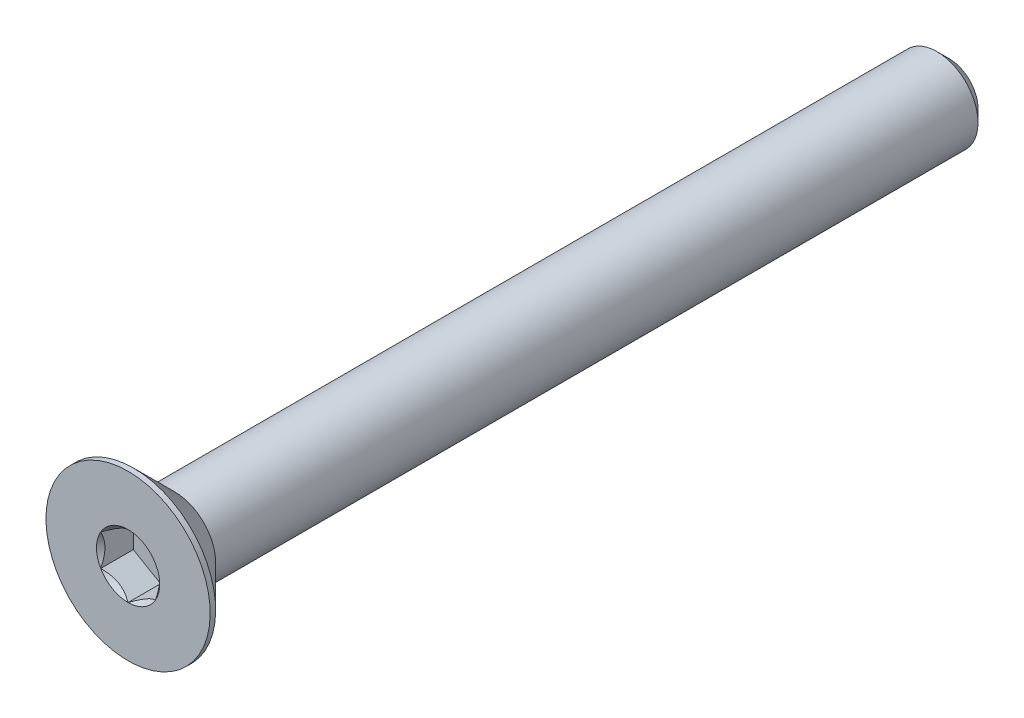
ISO-10303-21;
HEADER;
FILE_DESCRIPTION(('STEP AP214'),'2;1');
FILE_NAME('part.step','',(''),(''),'','','');
FILE_SCHEMA(('AUTOMOTIVE_DESIGN { 1 0 10303 214 1 1 1 1 }'));
ENDSEC;
DATA;
#1=APPLICATION_CONTEXT('core data for automotive mechanical design processes');
#2=APPLICATION_PROTOCOL_DEFINITION('international standard','automotive_design',2000,#1);
#3=PRODUCT_CONTEXT('',#1,'mechanical');
#4=PRODUCT('Part','Part','',(#3));
#5=PRODUCT_RELATED_PRODUCT_CATEGORY('part','',(#4));
#6=PRODUCT_DEFINITION_FORMATION('','',#4);
#7=PRODUCT_DEFINITION_CONTEXT('part definition',#1,'design');
#8=PRODUCT_DEFINITION('design','',#6,#7);
#9=PRODUCT_DEFINITION_SHAPE('','',#8);
#10=(LENGTH_UNIT() NAMED_UNIT(*) SI_UNIT(.MILLI.,.METRE.));
#11=(NAMED_UNIT(*) PLANE_ANGLE_UNIT() SI_UNIT($,.RADIAN.));
#12=(NAMED_UNIT(*) SI_UNIT($,.STERADIAN.) SOLID_ANGLE_UNIT());
#13=UNCERTAINTY_MEASURE_WITH_UNIT(LENGTH_MEASURE(1.E-05),#10,'distance_accuracy_value','');
#14=(GEOMETRIC_REPRESENTATION_CONTEXT(3) GLOBAL_UNCERTAINTY_ASSIGNED_CONTEXT((#13)) GLOBAL_UNIT_ASSIGNED_CONTEXT((#10,
#11,#12)) REPRESENTATION_CONTEXT('',''));
#15=CARTESIAN_POINT('',(0.,0.,0.));
#16=DIRECTION('',(0.,0.,1.));
#17=DIRECTION('',(1.,0.,0.));
#18=AXIS2_PLACEMENT_3D('',#15,#16,#17);
#19=CARTESIAN_POINT('',(0.,0.,-15.));
#20=DIRECTION('',(0.,0.,-1.));
#21=DIRECTION('',(0.,1.,0.));
#22=AXIS2_PLACEMENT_3D('',#19,#20,#21);
#23=CYLINDRICAL_SURFACE('',#22,1.5);
#24=CARTESIAN_POINT('',(0.,0.,13.3));
#25=DIRECTION('',(0.,0.,-1.));
#26=DIRECTION('',(0.,1.,0.));
#27=AXIS2_PLACEMENT_3D('',#24,#25,#26);
#28=CIRCLE('',#27,1.5);
#29=CARTESIAN_POINT('',(0.,1.5,13.3));
#30=VERTEX_POINT('',#29);
#31=EDGE_CURVE('E11',#30,#30,#28,.F.);
#32=ORIENTED_EDGE('',*,*,#31,.F.);
#33=EDGE_LOOP('',(#32));
#34=FACE_BOUND('',#33,.T.);
#35=CARTESIAN_POINT('',(0.,0.,-14.55));
#36=DIRECTION('',(0.,0.,-1.));
#37=DIRECTION('',(0.,1.,0.));
#38=AXIS2_PLACEMENT_3D('',#35,#36,#37);
#39=CIRCLE('',#38,1.5);
#40=CARTESIAN_POINT('',(0.,1.5,-14.55));
#41=VERTEX_POINT('',#40);
#42=EDGE_CURVE('E50',#41,#41,#39,.F.);
#43=ORIENTED_EDGE('',*,*,#42,.T.);
#44=EDGE_LOOP('',(#43));
#45=FACE_BOUND('',#44,.T.);
#46=ADVANCED_FACE('F41',(#34,#45),#23,.T.);
#47=CARTESIAN_POINT('',(0.,1.5,-15.));
#48=DIRECTION('',(0.,0.,-1.));
#49=DIRECTION('',(0.,1.,0.));
#50=AXIS2_PLACEMENT_3D('',#47,#48,#49);
#51=PLANE('',#50);
#52=CARTESIAN_POINT('',(0.,0.,-15.));
#53=DIRECTION('',(0.,0.,-1.));
#54=DIRECTION('',(0.,1.,0.));
#55=AXIS2_PLACEMENT_3D('',#52,#53,#54);
#56=CIRCLE('',#55,1.04999999999999);
#57=CARTESIAN_POINT('',(0.,1.05,-15.));
#58=VERTEX_POINT('',#57);
#59=EDGE_CURVE('E166',#58,#58,#56,.T.);
#60=ORIENTED_EDGE('',*,*,#59,.T.);
#61=EDGE_LOOP('',(#60));
#62=FACE_BOUND('',#61,.T.);
#63=ADVANCED_FACE('F177',(#62),#51,.T.);
#64=CARTESIAN_POINT('',(0.,0.,-15.));
#65=DIRECTION('',(0.,0.,1.));
#66=DIRECTION('',(0.,-1.,0.));
#67=AXIS2_PLACEMENT_3D('',#64,#65,#66);
#68=CONICAL_SURFACE('',#67,1.05,0.785398163397453);
#69=ORIENTED_EDGE('',*,*,#42,.F.);
#70=EDGE_LOOP('',(#69));
#71=FACE_BOUND('',#70,.T.);
#72=ORIENTED_EDGE('',*,*,#59,.F.);
#73=EDGE_LOOP('',(#72));
#74=FACE_BOUND('',#73,.T.);
#75=ADVANCED_FACE('F43',(#71,#74),#68,.T.);
#76=CARTESIAN_POINT('',(0.,0.,-15.));
#77=DIRECTION('',(0.,0.,-1.));
#78=DIRECTION('',(0.,1.,0.));
#79=AXIS2_PLACEMENT_3D('',#76,#77,#78);
#80=CYLINDRICAL_SURFACE('',#79,3.);
#81=CARTESIAN_POINT('',(0.,0.,15.));
#82=DIRECTION('',(0.,0.,-1.));
#83=DIRECTION('',(0.,1.,0.));
#84=AXIS2_PLACEMENT_3D('',#81,#82,#83);
#85=CIRCLE('',#84,3.);
#86=CARTESIAN_POINT('',(0.,3.,15.));
#87=VERTEX_POINT('',#86);
#88=EDGE_CURVE('E141',#87,#87,#85,.T.);
#89=ORIENTED_EDGE('',*,*,#88,.T.);
#90=EDGE_LOOP('',(#89));
#91=FACE_BOUND('',#90,.T.);
#92=CARTESIAN_POINT('',(0.,0.,14.8));
#93=DIRECTION('',(0.,0.,-1.));
#94=DIRECTION('',(0.,1.,0.));
#95=AXIS2_PLACEMENT_3D('',#92,#93,#94);
#96=CIRCLE('',#95,3.);
#97=CARTESIAN_POINT('',(0.,3.,14.8));
#98=VERTEX_POINT('',#97);
#99=EDGE_CURVE('E136',#98,#98,#96,.T.);
#100=ORIENTED_EDGE('',*,*,#99,.F.);
#101=EDGE_LOOP('',(#100));
#102=FACE_BOUND('',#101,.T.);
#103=ADVANCED_FACE('F176',(#91,#102),#80,.T.);
#104=CARTESIAN_POINT('',(0.,0.,13.3));
#105=DIRECTION('',(0.,0.,1.));
#106=DIRECTION('',(0.,-1.,0.));
#107=AXIS2_PLACEMENT_3D('',#104,#105,#106);
#108=CONICAL_SURFACE('',#107,1.5,0.78539816339745);
#109=ORIENTED_EDGE('',*,*,#99,.T.);
#110=EDGE_LOOP('',(#109));
#111=FACE_BOUND('',#110,.T.);
#112=ORIENTED_EDGE('',*,*,#31,.T.);
#113=EDGE_LOOP('',(#112));
#114=FACE_BOUND('',#113,.T.);
#115=ADVANCED_FACE('F190',(#111,#114),#108,.T.);
#116=CARTESIAN_POINT('',(0.,0.,15.));
#117=DIRECTION('',(0.,0.,1.));
#118=DIRECTION('',(0.,-1.,0.));
#119=AXIS2_PLACEMENT_3D('',#116,#117,#118);
#120=PLANE('',#119);
#121=CARTESIAN_POINT('',(0.,0.,15.));
#122=DIRECTION('',(0.,0.,1.));
#123=DIRECTION('',(1.,0.,0.));
#124=AXIS2_PLACEMENT_3D('',#121,#122,#123);
#125=CIRCLE('',#124,1.15470053837925);
#126=CARTESIAN_POINT('',(1.,0.577350269189629,15.));
#127=VERTEX_POINT('',#126);
#128=CARTESIAN_POINT('',(0.,1.15470053837926,15.));
#129=VERTEX_POINT('',#128);
#130=EDGE_CURVE('E101',#127,#129,#125,.T.);
#131=ORIENTED_EDGE('',*,*,#130,.F.);
#132=CARTESIAN_POINT('',(0.,0.,15.));
#133=DIRECTION('',(0.,0.,1.));
#134=DIRECTION('',(1.,0.,0.));
#135=AXIS2_PLACEMENT_3D('',#132,#133,#134);
#136=CIRCLE('',#135,1.15470053837925);
#137=CARTESIAN_POINT('',(0.999999999999989,-0.577350269189633,15.));
#138=VERTEX_POINT('',#137);
#139=EDGE_CURVE('E114',#138,#127,#136,.T.);
#140=ORIENTED_EDGE('',*,*,#139,.F.);
#141=CARTESIAN_POINT('',(0.,0.,15.));
#142=DIRECTION('',(0.,0.,1.));
#143=DIRECTION('',(1.,0.,0.));
#144=AXIS2_PLACEMENT_3D('',#141,#142,#143);
#145=CIRCLE('',#144,1.15470053837925);
#146=CARTESIAN_POINT('',(0.,-1.15470053837924,15.));
#147=VERTEX_POINT('',#146);
#148=EDGE_CURVE('E270',#147,#138,#145,.T.);
#149=ORIENTED_EDGE('',*,*,#148,.F.);
#150=CARTESIAN_POINT('',(0.,0.,15.));
#151=DIRECTION('',(0.,0.,1.));
#152=DIRECTION('',(1.,0.,0.));
#153=AXIS2_PLACEMENT_3D('',#150,#151,#152);
#154=CIRCLE('',#153,1.15470053837925);
#155=CARTESIAN_POINT('',(-1.,-0.577350269189614,15.));
#156=VERTEX_POINT('',#155);
#157=EDGE_CURVE('E130',#156,#147,#154,.T.);
#158=ORIENTED_EDGE('',*,*,#157,.F.);
#159=CARTESIAN_POINT('',(0.,0.,15.));
#160=DIRECTION('',(0.,0.,1.));
#161=DIRECTION('',(1.,0.,0.));
#162=AXIS2_PLACEMENT_3D('',#159,#160,#161);
#163=CIRCLE('',#162,1.15470053837925);
#164=CARTESIAN_POINT('',(-1.,0.577350269189625,15.));
#165=VERTEX_POINT('',#164);
#166=EDGE_CURVE('E271',#165,#156,#163,.T.);
#167=ORIENTED_EDGE('',*,*,#166,.F.);
#168=CARTESIAN_POINT('',(0.,0.,15.));
#169=DIRECTION('',(0.,0.,1.));
#170=DIRECTION('',(1.,0.,0.));
#171=AXIS2_PLACEMENT_3D('',#168,#169,#170);
#172=CIRCLE('',#171,1.15470053837925);
#173=EDGE_CURVE('E117',#129,#165,#172,.T.);
#174=ORIENTED_EDGE('',*,*,#173,.F.);
#175=EDGE_LOOP('',(#131,#140,#149,#158,#167,#174));
#176=FACE_BOUND('',#175,.T.);
#177=ORIENTED_EDGE('',*,*,#88,.F.);
#178=EDGE_LOOP('',(#177));
#179=FACE_BOUND('',#178,.T.);
#180=ADVANCED_FACE('F111',(#176,#179),#120,.T.);
#181=CARTESIAN_POINT('',(1.,0.577350269189626,13.81));
#182=DIRECTION('',(0.5,0.866025403784438,0.));
#183=DIRECTION('',(-0.866025403784439,0.5,0.));
#184=AXIS2_PLACEMENT_3D('',#181,#182,#183);
#185=PLANE('',#184);
#186=DIRECTION('',(0.,0.,1.));
#187=VECTOR('',#186,1.);
#188=CARTESIAN_POINT('',(1.,0.577350269189626,13.81));
#189=LINE('',#188,#187);
#190=CARTESIAN_POINT('',(1.,0.577350269189626,13.81));
#191=VERTEX_POINT('',#190);
#192=EDGE_CURVE('E57',#191,#127,#189,.T.);
#193=ORIENTED_EDGE('',*,*,#192,.T.);
#194=CARTESIAN_POINT('',(-0.000199999999999858,1.15481600843309,15.0001154873726));
#195=CARTESIAN_POINT('',(0.0341825950071808,1.13496520795026,14.9802779308257));
#196=CARTESIAN_POINT('',(0.0691401181398249,1.11478247255942,14.9616050206389));
#197=CARTESIAN_POINT('',(0.140422802956089,1.07362739529219,14.9274147427232));
#198=CARTESIAN_POINT('',(0.176754750528984,1.0526511355808,14.9119164090235));
#199=CARTESIAN_POINT('',(0.250016613803311,1.01035337909803,14.8853673071423));
#200=CARTESIAN_POINT('',(0.286927851445414,0.989042666109241,14.8742497739969));
#201=CARTESIAN_POINT('',(0.361562729310859,0.945952199282692,14.8571198657762));
#202=CARTESIAN_POINT('',(0.399284088108635,0.924173762626597,14.8510946974667));
#203=CARTESIAN_POINT('',(0.464292198417933,0.886641312640016,14.8456605549675));
#204=CARTESIAN_POINT('',(0.491494371528171,0.870936130672277,14.8448569383167));
#205=CARTESIAN_POINT('',(0.545846040669111,0.83955617986285,14.8462066994169));
#206=CARTESIAN_POINT('',(0.572995523754874,0.823881418494925,14.8483607295472));
#207=CARTESIAN_POINT('',(0.654056277326958,0.777080970599368,14.8591169721285));
#208=CARTESIAN_POINT('',(0.707564140978425,0.746188191116432,14.8720145564154));
#209=CARTESIAN_POINT('',(0.801476065143429,0.691968116419651,14.9031407306022));
#210=CARTESIAN_POINT('',(0.842320523671833,0.668386557293373,14.9197377977018));
#211=CARTESIAN_POINT('',(0.922409637381943,0.622147085933682,14.9571249246853));
#212=CARTESIAN_POINT('',(0.961659010870437,0.599486449584576,14.9779013418174));
#213=CARTESIAN_POINT('',(1.0002,0.577234799135788,15.0001154873726));
#214=B_SPLINE_CURVE_WITH_KNOTS('',3,(#194,#195,#196,#197,#198,#199,#200,#201,#202,#203,#204,
#205,#206,#207,#208,#209,#210,#211,#212,#213),.UNSPECIFIED.,.F.,.F.,(4,2,2,2,2,2,2,2,2,4),(0.,
0.133237676828559,0.26725222983449,0.399137076269299,0.530689603280767,0.624814864263844,
0.718960890149131,0.907306626112094,1.05710100361789,1.20641411519286),.UNSPECIFIED.);
#215=EDGE_CURVE('E98',#129,#127,#214,.T.);
#216=ORIENTED_EDGE('',*,*,#215,.F.);
#217=DIRECTION('',(0.,0.,1.));
#218=VECTOR('',#217,1.);
#219=CARTESIAN_POINT('',(0.,1.15470053837925,13.81));
#220=LINE('',#219,#218);
#221=CARTESIAN_POINT('',(0.,1.15470053837925,13.81));
#222=VERTEX_POINT('',#221);
#223=EDGE_CURVE('E160',#222,#129,#220,.T.);
#224=ORIENTED_EDGE('',*,*,#223,.F.);
#225=DIRECTION('',(-0.866025403784439,0.5,0.));
#226=VECTOR('',#225,1.);
#227=CARTESIAN_POINT('',(1.,0.577350269189626,13.81));
#228=LINE('',#227,#226);
#229=EDGE_CURVE('E126',#191,#222,#228,.T.);
#230=ORIENTED_EDGE('',*,*,#229,.F.);
#231=EDGE_LOOP('',(#193,#216,#224,#230));
#232=FACE_BOUND('',#231,.T.);
#233=ADVANCED_FACE('F132',(#232),#185,.F.);
#234=CARTESIAN_POINT('',(1.,-0.577350269189627,13.81));
#235=DIRECTION('',(1.,0.,0.));
#236=DIRECTION('',(0.,0.,-1.));
#237=AXIS2_PLACEMENT_3D('',#234,#235,#236);
#238=PLANE('',#237);
#239=DIRECTION('',(0.,0.,1.));
#240=VECTOR('',#239,1.);
#241=CARTESIAN_POINT('',(1.,-0.577350269189627,13.81));
#242=LINE('',#241,#240);
#243=CARTESIAN_POINT('',(1.,-0.577350269189627,13.81));
#244=VERTEX_POINT('',#243);
#245=EDGE_CURVE('E65',#244,#138,#242,.T.);
#246=ORIENTED_EDGE('',*,*,#245,.T.);
#247=CARTESIAN_POINT('',(1.,-1.15147208646462,15.3703856775139));
#248=CARTESIAN_POINT('',(1.,-1.12343447988552,15.3492199198737));
#249=CARTESIAN_POINT('',(1.,-1.09524064850698,15.3282616921759));
#250=CARTESIAN_POINT('',(1.,-1.03847715644377,15.2868460222356));
#251=CARTESIAN_POINT('',(1.,-1.00990740382976,15.2663887061237));
#252=CARTESIAN_POINT('',(1.,-0.923120894333482,15.2056047949545));
#253=CARTESIAN_POINT('',(1.,-0.864253173759064,15.1661922289614));
#254=CARTESIAN_POINT('',(1.,-0.74080985825805,15.0888206642002));
#255=CARTESIAN_POINT('',(1.,-0.676100255137811,15.0510730391143));
#256=CARTESIAN_POINT('',(1.,-0.543448939049127,14.9820245875513));
#257=CARTESIAN_POINT('',(1.,-0.47551911202778,14.9507020278469));
#258=CARTESIAN_POINT('',(1.,-0.373555850333529,14.9123817788838));
#259=CARTESIAN_POINT('',(1.,-0.341031989670907,14.9013835916422));
#260=CARTESIAN_POINT('',(1.,-0.275199079052292,14.8819983421474));
#261=CARTESIAN_POINT('',(1.,-0.241889975173931,14.8736114597767));
#262=CARTESIAN_POINT('',(1.,-0.17524751704299,14.860025220719));
#263=CARTESIAN_POINT('',(1.,-0.141925568218172,14.854770790768));
#264=CARTESIAN_POINT('',(1.,-0.0749144362322753,14.8475486865709));
#265=CARTESIAN_POINT('',(1.,-0.0412251978501577,14.8455815136105));
#266=CARTESIAN_POINT('',(1.,0.0249580992634254,14.8450831983932));
#267=CARTESIAN_POINT('',(1.,0.0574512826460437,14.8464302678886));
#268=CARTESIAN_POINT('',(1.,0.122148505701871,14.852216484499));
#269=CARTESIAN_POINT('',(1.,0.154352610132931,14.8566549206615));
#270=CARTESIAN_POINT('',(1.,0.218799898867645,14.8684568301452));
#271=CARTESIAN_POINT('',(1.,0.251033743268959,14.8758705410385));
#272=CARTESIAN_POINT('',(1.,0.314797132354925,14.8932289424987));
#273=CARTESIAN_POINT('',(1.,0.34632673573101,14.9031734212888));
#274=CARTESIAN_POINT('',(1.,0.445594187730211,14.9382234825543));
#275=CARTESIAN_POINT('',(1.,0.511919139476042,14.9673208583567));
#276=CARTESIAN_POINT('',(1.,0.641453244657538,15.0320153296865));
#277=CARTESIAN_POINT('',(1.,0.70465013312635,15.0676357767152));
#278=CARTESIAN_POINT('',(1.,0.825428490174991,15.1411239013469));
#279=CARTESIAN_POINT('',(1.,0.883132947867689,15.1787919471355));
#280=CARTESIAN_POINT('',(1.,0.968148853704569,15.2370228529432));
#281=CARTESIAN_POINT('',(1.,0.996120570380289,15.2566384757629));
#282=CARTESIAN_POINT('',(1.,1.05168177729902,15.2963885170613));
#283=CARTESIAN_POINT('',(1.,1.07927136997701,15.3165227921988));
#284=CARTESIAN_POINT('',(1.,1.1067018534633,15.336872119073));
#285=B_SPLINE_CURVE_WITH_KNOTS('',3,(#247,#248,#249,#250,#251,#252,#253,#254,#255,#256,#257,
#258,#259,#260,#261,#262,#263,#264,#265,#266,#267,#268,#269,#270,#271,#272,#273,#274,#275,#276,
#277,#278,#279,#280,#281,#282,#283,#284),.UNSPECIFIED.,.F.,.F.,(4,2,2,2,2,2,2,2,2,2,2,2,2,2,2,2,
2,2,4),(0.,0.105386459083291,0.210799187330125,0.423233611565472,0.647793540908509,
0.871580877738619,0.974493074181431,1.07741235827202,1.17846428203206,1.27953161415764,
1.37694086739612,1.47432772585409,1.57343322804295,1.67253043972853,1.88917353996829,
2.10660791038814,2.31323734249845,2.41572589232046,2.51818641476504),.UNSPECIFIED.);
#286=EDGE_CURVE('E124',#127,#138,#285,.F.);
#287=ORIENTED_EDGE('',*,*,#286,.F.);
#288=ORIENTED_EDGE('',*,*,#192,.F.);
#289=DIRECTION('',(0.,1.,0.));
#290=VECTOR('',#289,1.);
#291=CARTESIAN_POINT('',(1.,-0.577350269189627,13.81));
#292=LINE('',#291,#290);
#293=EDGE_CURVE('E146',#244,#191,#292,.T.);
#294=ORIENTED_EDGE('',*,*,#293,.F.);
#295=EDGE_LOOP('',(#246,#287,#288,#294));
#296=FACE_BOUND('',#295,.T.);
#297=ADVANCED_FACE('F128',(#296),#238,.F.);
#298=CARTESIAN_POINT('',(0.,-1.15470053837925,13.81));
#299=DIRECTION('',(0.5,-0.866025403784439,0.));
#300=DIRECTION('',(0.866025403784439,0.5,0.));
#301=AXIS2_PLACEMENT_3D('',#298,#299,#300);
#302=PLANE('',#301);
#303=DIRECTION('',(0.,0.,1.));
#304=VECTOR('',#303,1.);
#305=CARTESIAN_POINT('',(0.,-1.15470053837925,13.81));
#306=LINE('',#305,#304);
#307=CARTESIAN_POINT('',(0.,-1.15470053837925,13.81));
#308=VERTEX_POINT('',#307);
#309=EDGE_CURVE('E143',#308,#147,#306,.T.);
#310=ORIENTED_EDGE('',*,*,#309,.T.);
#311=CARTESIAN_POINT('',(1.0002,-0.577234799135789,15.0001154873726));
#312=CARTESIAN_POINT('',(0.965817404992819,-0.597085599618622,14.9802779308257));
#313=CARTESIAN_POINT('',(0.930859881860175,-0.617268335009457,14.9616050206389));
#314=CARTESIAN_POINT('',(0.859577197043911,-0.658423412276686,14.9274147427232));
#315=CARTESIAN_POINT('',(0.823245249471016,-0.67939967198808,14.9119164090235));
#316=CARTESIAN_POINT('',(0.74998338619669,-0.721697428470846,14.8853673071423));
#317=CARTESIAN_POINT('',(0.713072148554587,-0.743008141459637,14.8742497739969));
#318=CARTESIAN_POINT('',(0.638437270689143,-0.786098608286186,14.8571198657762));
#319=CARTESIAN_POINT('',(0.600715911891366,-0.80787704494228,14.8510946974667));
#320=CARTESIAN_POINT('',(0.535707801582069,-0.845409494928862,14.8456605549675));
#321=CARTESIAN_POINT('',(0.50850562847183,-0.861114676896601,14.8448569383167));
#322=CARTESIAN_POINT('',(0.45415395933089,-0.892494627706028,14.8462066994169));
#323=CARTESIAN_POINT('',(0.427004476245126,-0.908169389073953,14.8483607295472));
#324=CARTESIAN_POINT('',(0.345943722673041,-0.95496983696951,14.8591169721285));
#325=CARTESIAN_POINT('',(0.292435859021573,-0.985862616452447,14.8720145564154));
#326=CARTESIAN_POINT('',(0.198523934856568,-1.04008269114923,14.9031407306022));
#327=CARTESIAN_POINT('',(0.157679476328165,-1.06366425027551,14.9197377977018));
#328=CARTESIAN_POINT('',(0.0775903626180559,-1.1099037216352,14.9571249246853));
#329=CARTESIAN_POINT('',(0.0383409891295621,-1.1325643579843,14.9779013418174));
#330=CARTESIAN_POINT('',(-0.000199999999999999,-1.15481600843309,15.0001154873726));
#331=B_SPLINE_CURVE_WITH_KNOTS('',3,(#311,#312,#313,#314,#315,#316,#317,#318,#319,#320,#321,
#322,#323,#324,#325,#326,#327,#328,#329,#330),.UNSPECIFIED.,.F.,.F.,(4,2,2,2,2,2,2,2,2,4),(0.,
0.133237676828559,0.267252229834488,0.399137076269297,0.530689603280764,0.624814864263842,
0.71896089014913,0.907306626112096,1.05710100361789,1.20641411519286),.UNSPECIFIED.);
#332=EDGE_CURVE('E267',#138,#147,#331,.T.);
#333=ORIENTED_EDGE('',*,*,#332,.F.);
#334=ORIENTED_EDGE('',*,*,#245,.F.);
#335=DIRECTION('',(0.866025403784439,0.5,0.));
#336=VECTOR('',#335,1.);
#337=CARTESIAN_POINT('',(0.,-1.15470053837925,13.81));
#338=LINE('',#337,#336);
#339=EDGE_CURVE('E257',#308,#244,#338,.T.);
#340=ORIENTED_EDGE('',*,*,#339,.F.);
#341=EDGE_LOOP('',(#310,#333,#334,#340));
#342=FACE_BOUND('',#341,.T.);
#343=ADVANCED_FACE('F216',(#342),#302,.F.);
#344=CARTESIAN_POINT('',(-1.,-0.577350269189626,13.81));
#345=DIRECTION('',(-0.5,-0.866025403784439,0.));
#346=DIRECTION('',(0.866025403784439,-0.5,0.));
#347=AXIS2_PLACEMENT_3D('',#344,#345,#346);
#348=PLANE('',#347);
#349=DIRECTION('',(0.,0.,1.));
#350=VECTOR('',#349,1.);
#351=CARTESIAN_POINT('',(-1.,-0.577350269189626,13.81));
#352=LINE('',#351,#350);
#353=CARTESIAN_POINT('',(-1.,-0.577350269189626,13.81));
#354=VERTEX_POINT('',#353);
#355=EDGE_CURVE('E152',#354,#156,#352,.T.);
#356=ORIENTED_EDGE('',*,*,#355,.T.);
#357=CARTESIAN_POINT('',(0.000199999999999887,-1.15481600843309,15.0001154873726));
#358=CARTESIAN_POINT('',(-0.0341825950071809,-1.13496520795026,14.9802779308257));
#359=CARTESIAN_POINT('',(-0.0691401181398253,-1.11478247255942,14.9616050206389));
#360=CARTESIAN_POINT('',(-0.14042280295609,-1.07362739529219,14.9274147427232));
#361=CARTESIAN_POINT('',(-0.176754750528985,-1.0526511355808,14.9119164090235));
#362=CARTESIAN_POINT('',(-0.250016613803313,-1.01035337909803,14.8853673071423));
#363=CARTESIAN_POINT('',(-0.286927851445416,-0.98904266610924,14.8742497739969));
#364=CARTESIAN_POINT('',(-0.361562729310861,-0.94595219928269,14.8571198657762));
#365=CARTESIAN_POINT('',(-0.399284088108638,-0.924173762626595,14.8510946974667));
#366=CARTESIAN_POINT('',(-0.464292198417936,-0.886641312640013,14.8456605549675));
#367=CARTESIAN_POINT('',(-0.491494371528175,-0.870936130672274,14.8448569383167));
#368=CARTESIAN_POINT('',(-0.545846040669115,-0.839556179862847,14.8462066994169));
#369=CARTESIAN_POINT('',(-0.572995523754879,-0.823881418494922,14.8483607295472));
#370=CARTESIAN_POINT('',(-0.654056277326964,-0.777080970599365,14.8591169721285));
#371=CARTESIAN_POINT('',(-0.707564140978432,-0.746188191116428,14.8720145564154));
#372=CARTESIAN_POINT('',(-0.801476065143435,-0.691968116419647,14.9031407306022));
#373=CARTESIAN_POINT('',(-0.842320523671837,-0.66838655729337,14.9197377977018));
#374=CARTESIAN_POINT('',(-0.922409637381945,-0.62214708593368,14.9571249246853));
#375=CARTESIAN_POINT('',(-0.961659010870439,-0.599486449584575,14.9779013418174));
#376=CARTESIAN_POINT('',(-1.0002,-0.577234799135788,15.0001154873726));
#377=B_SPLINE_CURVE_WITH_KNOTS('',3,(#357,#358,#359,#360,#361,#362,#363,#364,#365,#366,#367,
#368,#369,#370,#371,#372,#373,#374,#375,#376),.UNSPECIFIED.,.F.,.F.,(4,2,2,2,2,2,2,2,2,4),(0.,
0.133237676828559,0.267252229834491,0.399137076269302,0.530689603280771,0.624814864263849,
0.718960890149137,0.907306626112103,1.0571010036179,1.20641411519286),.UNSPECIFIED.);
#378=EDGE_CURVE('E233',#147,#156,#377,.T.);
#379=ORIENTED_EDGE('',*,*,#378,.F.);
#380=ORIENTED_EDGE('',*,*,#309,.F.);
#381=DIRECTION('',(0.866025403784439,-0.5,0.));
#382=VECTOR('',#381,1.);
#383=CARTESIAN_POINT('',(-1.,-0.577350269189626,13.81));
#384=LINE('',#383,#382);
#385=EDGE_CURVE('E254',#354,#308,#384,.T.);
#386=ORIENTED_EDGE('',*,*,#385,.F.);
#387=EDGE_LOOP('',(#356,#379,#380,#386));
#388=FACE_BOUND('',#387,.T.);
#389=ADVANCED_FACE('F212',(#388),#348,.F.);
#390=CARTESIAN_POINT('',(-1.,0.577350269189626,13.81));
#391=DIRECTION('',(-1.,0.,0.));
#392=DIRECTION('',(0.,-1.,0.));
#393=AXIS2_PLACEMENT_3D('',#390,#391,#392);
#394=PLANE('',#393);
#395=DIRECTION('',(0.,0.,1.));
#396=VECTOR('',#395,1.);
#397=CARTESIAN_POINT('',(-1.,0.577350269189626,13.81));
#398=LINE('',#397,#396);
#399=CARTESIAN_POINT('',(-1.,0.577350269189626,13.81));
#400=VERTEX_POINT('',#399);
#401=EDGE_CURVE('E156',#400,#165,#398,.T.);
#402=ORIENTED_EDGE('',*,*,#401,.T.);
#403=CARTESIAN_POINT('',(-1.,-1.15147208646462,15.3703856775139));
#404=CARTESIAN_POINT('',(-1.,-1.12343447988552,15.3492199198737));
#405=CARTESIAN_POINT('',(-1.,-1.09524064850698,15.3282616921759));
#406=CARTESIAN_POINT('',(-1.,-1.03847715644377,15.2868460222356));
#407=CARTESIAN_POINT('',(-1.,-1.00990740382975,15.2663887061237));
#408=CARTESIAN_POINT('',(-1.,-0.92312089433348,15.2056047949545));
#409=CARTESIAN_POINT('',(-1.,-0.864253173759062,15.1661922289614));
#410=CARTESIAN_POINT('',(-1.,-0.740809858258047,15.0888206642002));
#411=CARTESIAN_POINT('',(-1.,-0.676100255137808,15.0510730391143));
#412=CARTESIAN_POINT('',(-1.,-0.543448939049124,14.9820245875513));
#413=CARTESIAN_POINT('',(-1.,-0.475519112027778,14.9507020278469));
#414=CARTESIAN_POINT('',(-1.,-0.373555850333527,14.9123817788838));
#415=CARTESIAN_POINT('',(-1.,-0.341031989670906,14.9013835916422));
#416=CARTESIAN_POINT('',(-1.,-0.275199079052291,14.8819983421474));
#417=CARTESIAN_POINT('',(-1.,-0.24188997517393,14.8736114597767));
#418=CARTESIAN_POINT('',(-1.,-0.175247517042989,14.860025220719));
#419=CARTESIAN_POINT('',(-1.,-0.141925568218171,14.854770790768));
#420=CARTESIAN_POINT('',(-1.,-0.0749144362322749,14.8475486865709));
#421=CARTESIAN_POINT('',(-1.,-0.0412251978501575,14.8455815136105));
#422=CARTESIAN_POINT('',(-1.,0.0249580992634257,14.8450831983932));
#423=CARTESIAN_POINT('',(-1.,0.0574512826460442,14.8464302678886));
#424=CARTESIAN_POINT('',(-1.,0.122148505701872,14.852216484499));
#425=CARTESIAN_POINT('',(-1.,0.154352610132932,14.8566549206615));
#426=CARTESIAN_POINT('',(-1.,0.218799898867645,14.8684568301452));
#427=CARTESIAN_POINT('',(-1.,0.251033743268959,14.8758705410385));
#428=CARTESIAN_POINT('',(-1.,0.314797132354925,14.8932289424987));
#429=CARTESIAN_POINT('',(-1.,0.346326735731011,14.9031734212888));
#430=CARTESIAN_POINT('',(-1.,0.445594187730211,14.9382234825543));
#431=CARTESIAN_POINT('',(-1.,0.511919139476043,14.9673208583567));
#432=CARTESIAN_POINT('',(-1.,0.641453244657538,15.0320153296865));
#433=CARTESIAN_POINT('',(-1.,0.70465013312635,15.0676357767152));
#434=CARTESIAN_POINT('',(-1.,0.825428490174992,15.1411239013469));
#435=CARTESIAN_POINT('',(-1.,0.883132947867689,15.1787919471355));
#436=CARTESIAN_POINT('',(-1.,0.96814885370457,15.2370228529432));
#437=CARTESIAN_POINT('',(-1.,0.99612057038029,15.2566384757629));
#438=CARTESIAN_POINT('',(-1.,1.05168177729902,15.2963885170613));
#439=CARTESIAN_POINT('',(-1.,1.07927136997701,15.3165227921988));
#440=CARTESIAN_POINT('',(-1.,1.1067018534633,15.336872119073));
#441=B_SPLINE_CURVE_WITH_KNOTS('',3,(#403,#404,#405,#406,#407,#408,#409,#410,#411,#412,#413,
#414,#415,#416,#417,#418,#419,#420,#421,#422,#423,#424,#425,#426,#427,#428,#429,#430,#431,#432,
#433,#434,#435,#436,#437,#438,#439,#440),.UNSPECIFIED.,.F.,.F.,(4,2,2,2,2,2,2,2,2,2,2,2,2,2,2,2,
2,2,4),(0.,0.105386459083291,0.210799187330125,0.423233611565473,0.647793540908509,
0.871580877738618,0.974493074181429,1.07741235827202,1.17846428203206,1.27953161415763,
1.37694086739612,1.47432772585409,1.57343322804295,1.67253043972853,1.88917353996829,
2.10660791038814,2.31323734249844,2.41572589232046,2.51818641476504),.UNSPECIFIED.);
#442=EDGE_CURVE('E105',#156,#165,#441,.T.);
#443=ORIENTED_EDGE('',*,*,#442,.F.);
#444=ORIENTED_EDGE('',*,*,#355,.F.);
#445=DIRECTION('',(0.,-1.,0.));
#446=VECTOR('',#445,1.);
#447=CARTESIAN_POINT('',(-1.,0.577350269189626,13.81));
#448=LINE('',#447,#446);
#449=EDGE_CURVE('E250',#400,#354,#448,.T.);
#450=ORIENTED_EDGE('',*,*,#449,.F.);
#451=EDGE_LOOP('',(#402,#443,#444,#450));
#452=FACE_BOUND('',#451,.T.);
#453=ADVANCED_FACE('F208',(#452),#394,.F.);
#454=CARTESIAN_POINT('',(0.,1.15470053837925,13.81));
#455=DIRECTION('',(-0.5,0.866025403784439,0.));
#456=DIRECTION('',(-0.866025403784439,-0.5,0.));
#457=AXIS2_PLACEMENT_3D('',#454,#455,#456);
#458=PLANE('',#457);
#459=ORIENTED_EDGE('',*,*,#223,.T.);
#460=CARTESIAN_POINT('',(-1.0002,0.577234799135788,15.0001154873726));
#461=CARTESIAN_POINT('',(-0.965817404992819,0.597085599618622,14.9802779308257));
#462=CARTESIAN_POINT('',(-0.930859881860175,0.617268335009457,14.9616050206389));
#463=CARTESIAN_POINT('',(-0.85957719704391,0.658423412276686,14.9274147427232));
#464=CARTESIAN_POINT('',(-0.823245249471016,0.67939967198808,14.9119164090235));
#465=CARTESIAN_POINT('',(-0.749983386196688,0.721697428470847,14.8853673071423));
#466=CARTESIAN_POINT('',(-0.713072148554585,0.743008141459637,14.8742497739969));
#467=CARTESIAN_POINT('',(-0.63843727068914,0.786098608286187,14.8571198657762));
#468=CARTESIAN_POINT('',(-0.600715911891363,0.807877044942282,14.8510946974667));
#469=CARTESIAN_POINT('',(-0.535707801582065,0.845409494928864,14.8456605549675));
#470=CARTESIAN_POINT('',(-0.508505628471827,0.861114676896603,14.8448569383167));
#471=CARTESIAN_POINT('',(-0.454153959330887,0.89249462770603,14.8462066994169));
#472=CARTESIAN_POINT('',(-0.427004476245124,0.908169389073955,14.8483607295472));
#473=CARTESIAN_POINT('',(-0.345943722673039,0.954969836969511,14.8591169721285));
#474=CARTESIAN_POINT('',(-0.292435859021573,0.985862616452448,14.8720145564154));
#475=CARTESIAN_POINT('',(-0.198523934856569,1.04008269114923,14.9031407306022));
#476=CARTESIAN_POINT('',(-0.157679476328166,1.06366425027551,14.9197377977018));
#477=CARTESIAN_POINT('',(-0.0775903626180564,1.1099037216352,14.9571249246853));
#478=CARTESIAN_POINT('',(-0.0383409891295621,1.1325643579843,14.9779013418174));
#479=CARTESIAN_POINT('',(0.000200000000000169,1.15481600843309,15.0001154873726));
#480=B_SPLINE_CURVE_WITH_KNOTS('',3,(#460,#461,#462,#463,#464,#465,#466,#467,#468,#469,#470,
#471,#472,#473,#474,#475,#476,#477,#478,#479),.UNSPECIFIED.,.F.,.F.,(4,2,2,2,2,2,2,2,2,4),(0.,
0.13323767682856,0.267252229834491,0.399137076269302,0.530689603280771,0.624814864263848,
0.718960890149134,0.907306626112098,1.05710100361789,1.20641411519286),.UNSPECIFIED.);
#481=EDGE_CURVE('E263',#165,#129,#480,.T.);
#482=ORIENTED_EDGE('',*,*,#481,.F.);
#483=ORIENTED_EDGE('',*,*,#401,.F.);
#484=DIRECTION('',(-0.866025403784439,-0.5,0.));
#485=VECTOR('',#484,1.);
#486=CARTESIAN_POINT('',(0.,1.15470053837925,13.81));
#487=LINE('',#486,#485);
#488=EDGE_CURVE('E246',#222,#400,#487,.T.);
#489=ORIENTED_EDGE('',*,*,#488,.F.);
#490=EDGE_LOOP('',(#459,#482,#483,#489));
#491=FACE_BOUND('',#490,.T.);
#492=ADVANCED_FACE('F204',(#491),#458,.F.);
#493=CARTESIAN_POINT('',(0.,0.,13.81));
#494=DIRECTION('',(0.,0.,1.));
#495=DIRECTION('',(1.,0.,0.));
#496=AXIS2_PLACEMENT_3D('',#493,#494,#495);
#497=PLANE('',#496);
#498=ORIENTED_EDGE('',*,*,#229,.T.);
#499=ORIENTED_EDGE('',*,*,#488,.T.);
#500=ORIENTED_EDGE('',*,*,#449,.T.);
#501=ORIENTED_EDGE('',*,*,#385,.T.);
#502=ORIENTED_EDGE('',*,*,#339,.T.);
#503=ORIENTED_EDGE('',*,*,#293,.T.);
#504=EDGE_LOOP('',(#498,#499,#500,#501,#502,#503));
#505=FACE_BOUND('',#504,.T.);
#506=ADVANCED_FACE('F207',(#505),#497,.T.);
#507=CARTESIAN_POINT('',(0.,0.,15.));
#508=DIRECTION('',(0.,0.,1.));
#509=DIRECTION('',(1.,0.,0.));
#510=AXIS2_PLACEMENT_3D('',#507,#508,#509);
#511=CONICAL_SURFACE('',#510,1.15470053837925,0.78539816339745);
#512=ORIENTED_EDGE('',*,*,#481,.T.);
#513=ORIENTED_EDGE('',*,*,#173,.T.);
#514=EDGE_LOOP('',(#512,#513));
#515=FACE_BOUND('',#514,.T.);
#516=ADVANCED_FACE('F223',(#515),#511,.F.);
#517=CARTESIAN_POINT('',(0.,0.,15.));
#518=DIRECTION('',(0.,0.,1.));
#519=DIRECTION('',(1.,0.,0.));
#520=AXIS2_PLACEMENT_3D('',#517,#518,#519);
#521=CONICAL_SURFACE('',#520,1.15470053837925,0.78539816339745);
#522=ORIENTED_EDGE('',*,*,#378,.T.);
#523=ORIENTED_EDGE('',*,*,#157,.T.);
#524=EDGE_LOOP('',(#522,#523));
#525=FACE_BOUND('',#524,.T.);
#526=ADVANCED_FACE('F225',(#525),#521,.F.);
#527=CARTESIAN_POINT('',(0.,0.,15.));
#528=DIRECTION('',(0.,0.,1.));
#529=DIRECTION('',(1.,0.,0.));
#530=AXIS2_PLACEMENT_3D('',#527,#528,#529);
#531=CONICAL_SURFACE('',#530,1.15470053837925,0.78539816339745);
#532=ORIENTED_EDGE('',*,*,#286,.T.);
#533=ORIENTED_EDGE('',*,*,#139,.T.);
#534=EDGE_LOOP('',(#532,#533));
#535=FACE_BOUND('',#534,.T.);
#536=ADVANCED_FACE('F123',(#535),#531,.F.);
#537=CARTESIAN_POINT('',(0.,0.,15.));
#538=DIRECTION('',(0.,0.,1.));
#539=DIRECTION('',(1.,0.,0.));
#540=AXIS2_PLACEMENT_3D('',#537,#538,#539);
#541=CONICAL_SURFACE('',#540,1.15470053837925,0.78539816339745);
#542=ORIENTED_EDGE('',*,*,#332,.T.);
#543=ORIENTED_EDGE('',*,*,#148,.T.);
#544=EDGE_LOOP('',(#542,#543));
#545=FACE_BOUND('',#544,.T.);
#546=ADVANCED_FACE('F285',(#545),#541,.F.);
#547=CARTESIAN_POINT('',(0.,0.,15.));
#548=DIRECTION('',(0.,0.,1.));
#549=DIRECTION('',(1.,0.,0.));
#550=AXIS2_PLACEMENT_3D('',#547,#548,#549);
#551=CONICAL_SURFACE('',#550,1.15470053837925,0.78539816339745);
#552=ORIENTED_EDGE('',*,*,#442,.T.);
#553=ORIENTED_EDGE('',*,*,#166,.T.);
#554=EDGE_LOOP('',(#552,#553));
#555=FACE_BOUND('',#554,.T.);
#556=ADVANCED_FACE('F290',(#555),#551,.F.);
#557=CARTESIAN_POINT('',(0.,0.,15.));
#558=DIRECTION('',(0.,0.,1.));
#559=DIRECTION('',(1.,0.,0.));
#560=AXIS2_PLACEMENT_3D('',#557,#558,#559);
#561=CONICAL_SURFACE('',#560,1.15470053837925,0.78539816339745);
#562=ORIENTED_EDGE('',*,*,#215,.T.);
#563=ORIENTED_EDGE('',*,*,#130,.T.);
#564=EDGE_LOOP('',(#562,#563));
#565=FACE_BOUND('',#564,.T.);
#566=ADVANCED_FACE('F100',(#565),#561,.F.);
#567=CLOSED_SHELL('',(#46,#63,#75,#103,#115,#180,#233,#297,#343,#389,#453,#492,#506,#516,#526,
#536,#546,#556,#566));
#568=MANIFOLD_SOLID_BREP('B2',#567);
#569=ADVANCED_BREP_SHAPE_REPRESENTATION('',(#18,#568),#14);
#570=SHAPE_DEFINITION_REPRESENTATION(#9,#569);
ENDSEC;
END-ISO-10303-21;
